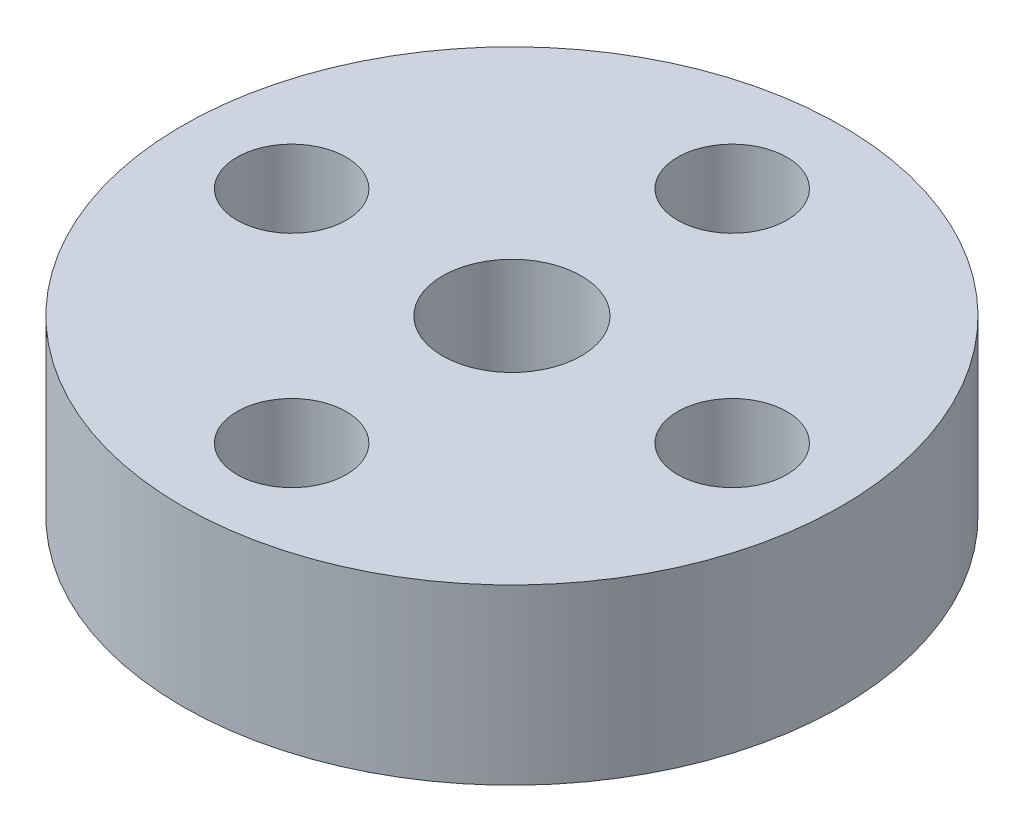
ISO-10303-21;
HEADER;
FILE_DESCRIPTION(('STEP AP214'),'2;1');
FILE_NAME('part.step','',(''),(''),'','','');
FILE_SCHEMA(('AUTOMOTIVE_DESIGN { 1 0 10303 214 1 1 1 1 }'));
ENDSEC;
DATA;
#1=APPLICATION_CONTEXT('core data for automotive mechanical design processes');
#2=APPLICATION_PROTOCOL_DEFINITION('international standard','automotive_design',2000,#1);
#3=PRODUCT_CONTEXT('',#1,'mechanical');
#4=PRODUCT('Part','Part','',(#3));
#5=PRODUCT_RELATED_PRODUCT_CATEGORY('part','',(#4));
#6=PRODUCT_DEFINITION_FORMATION('','',#4);
#7=PRODUCT_DEFINITION_CONTEXT('part definition',#1,'design');
#8=PRODUCT_DEFINITION('design','',#6,#7);
#9=PRODUCT_DEFINITION_SHAPE('','',#8);
#10=(LENGTH_UNIT() NAMED_UNIT(*) SI_UNIT(.MILLI.,.METRE.));
#11=(NAMED_UNIT(*) PLANE_ANGLE_UNIT() SI_UNIT($,.RADIAN.));
#12=(NAMED_UNIT(*) SI_UNIT($,.STERADIAN.) SOLID_ANGLE_UNIT());
#13=UNCERTAINTY_MEASURE_WITH_UNIT(LENGTH_MEASURE(1.E-05),#10,'distance_accuracy_value','');
#14=(GEOMETRIC_REPRESENTATION_CONTEXT(3) GLOBAL_UNCERTAINTY_ASSIGNED_CONTEXT((#13)) GLOBAL_UNIT_ASSIGNED_CONTEXT((#10,
#11,#12)) REPRESENTATION_CONTEXT('',''));
#15=CARTESIAN_POINT('',(0.,0.,0.));
#16=DIRECTION('',(0.,0.,1.));
#17=DIRECTION('',(1.,0.,0.));
#18=AXIS2_PLACEMENT_3D('',#15,#16,#17);
#19=CARTESIAN_POINT('',(0.,5.,0.));
#20=DIRECTION('',(0.,-1.,0.));
#21=DIRECTION('',(0.,0.,-1.));
#22=AXIS2_PLACEMENT_3D('',#19,#20,#21);
#23=CYLINDRICAL_SURFACE('',#22,9.5);
#24=CARTESIAN_POINT('',(0.,5.,0.));
#25=DIRECTION('',(0.,1.,0.));
#26=DIRECTION('',(0.,0.,1.));
#27=AXIS2_PLACEMENT_3D('',#24,#25,#26);
#28=CIRCLE('',#27,9.5);
#29=CARTESIAN_POINT('',(0.,5.,9.5));
#30=VERTEX_POINT('',#29);
#31=EDGE_CURVE('E10',#30,#30,#28,.T.);
#32=ORIENTED_EDGE('',*,*,#31,.F.);
#33=EDGE_LOOP('',(#32));
#34=FACE_BOUND('',#33,.T.);
#35=CARTESIAN_POINT('',(0.,0.,0.));
#36=DIRECTION('',(0.,1.,0.));
#37=DIRECTION('',(0.,0.,1.));
#38=AXIS2_PLACEMENT_3D('',#35,#36,#37);
#39=CIRCLE('',#38,9.5);
#40=CARTESIAN_POINT('',(0.,0.,9.5));
#41=VERTEX_POINT('',#40);
#42=EDGE_CURVE('E34',#41,#41,#39,.T.);
#43=ORIENTED_EDGE('',*,*,#42,.T.);
#44=EDGE_LOOP('',(#43));
#45=FACE_BOUND('',#44,.T.);
#46=ADVANCED_FACE('F31',(#34,#45),#23,.T.);
#47=CARTESIAN_POINT('',(0.,5.,0.));
#48=DIRECTION('',(0.,1.,0.));
#49=DIRECTION('',(0.,0.,1.));
#50=AXIS2_PLACEMENT_3D('',#47,#48,#49);
#51=PLANE('',#50);
#52=CARTESIAN_POINT('',(0.,5.,0.));
#53=DIRECTION('',(0.,1.,0.));
#54=DIRECTION('',(0.,0.,1.));
#55=AXIS2_PLACEMENT_3D('',#52,#53,#54);
#56=CIRCLE('',#55,2.);
#57=CARTESIAN_POINT('',(0.,5.,2.));
#58=VERTEX_POINT('',#57);
#59=EDGE_CURVE('E69',#58,#58,#56,.T.);
#60=ORIENTED_EDGE('',*,*,#59,.F.);
#61=EDGE_LOOP('',(#60));
#62=FACE_BOUND('',#61,.T.);
#63=CARTESIAN_POINT('',(-6.35,5.,0.));
#64=DIRECTION('',(0.,1.,0.));
#65=DIRECTION('',(0.,0.,1.));
#66=AXIS2_PLACEMENT_3D('',#63,#64,#65);
#67=CIRCLE('',#66,1.575);
#68=CARTESIAN_POINT('',(-6.35,5.,1.575));
#69=VERTEX_POINT('',#68);
#70=EDGE_CURVE('E63',#69,#69,#67,.T.);
#71=ORIENTED_EDGE('',*,*,#70,.F.);
#72=EDGE_LOOP('',(#71));
#73=FACE_BOUND('',#72,.T.);
#74=CARTESIAN_POINT('',(0.,5.,6.35));
#75=DIRECTION('',(0.,1.,0.));
#76=DIRECTION('',(0.,0.,1.));
#77=AXIS2_PLACEMENT_3D('',#74,#75,#76);
#78=CIRCLE('',#77,1.575);
#79=CARTESIAN_POINT('',(0.,5.,7.925));
#80=VERTEX_POINT('',#79);
#81=EDGE_CURVE('E57',#80,#80,#78,.T.);
#82=ORIENTED_EDGE('',*,*,#81,.F.);
#83=EDGE_LOOP('',(#82));
#84=FACE_BOUND('',#83,.T.);
#85=CARTESIAN_POINT('',(6.35,5.,0.));
#86=DIRECTION('',(0.,1.,0.));
#87=DIRECTION('',(0.,0.,1.));
#88=AXIS2_PLACEMENT_3D('',#85,#86,#87);
#89=CIRCLE('',#88,1.575);
#90=CARTESIAN_POINT('',(6.35,5.,1.575));
#91=VERTEX_POINT('',#90);
#92=EDGE_CURVE('E51',#91,#91,#89,.T.);
#93=ORIENTED_EDGE('',*,*,#92,.F.);
#94=EDGE_LOOP('',(#93));
#95=FACE_BOUND('',#94,.T.);
#96=CARTESIAN_POINT('',(0.,5.,-6.35));
#97=DIRECTION('',(0.,1.,0.));
#98=DIRECTION('',(0.,0.,1.));
#99=AXIS2_PLACEMENT_3D('',#96,#97,#98);
#100=CIRCLE('',#99,1.575);
#101=CARTESIAN_POINT('',(0.,5.,-4.775));
#102=VERTEX_POINT('',#101);
#103=EDGE_CURVE('E45',#102,#102,#100,.T.);
#104=ORIENTED_EDGE('',*,*,#103,.F.);
#105=EDGE_LOOP('',(#104));
#106=FACE_BOUND('',#105,.T.);
#107=ORIENTED_EDGE('',*,*,#31,.T.);
#108=EDGE_LOOP('',(#107));
#109=FACE_BOUND('',#108,.T.);
#110=ADVANCED_FACE('F75',(#62,#73,#84,#95,#106,#109),#51,.T.);
#111=CARTESIAN_POINT('',(0.,0.,0.));
#112=DIRECTION('',(0.,1.,0.));
#113=DIRECTION('',(0.,0.,1.));
#114=AXIS2_PLACEMENT_3D('',#111,#112,#113);
#115=PLANE('',#114);
#116=CARTESIAN_POINT('',(0.,0.,0.));
#117=DIRECTION('',(0.,1.,0.));
#118=DIRECTION('',(0.,0.,1.));
#119=AXIS2_PLACEMENT_3D('',#116,#117,#118);
#120=CIRCLE('',#119,2.);
#121=CARTESIAN_POINT('',(0.,0.,2.));
#122=VERTEX_POINT('',#121);
#123=EDGE_CURVE('E66',#122,#122,#120,.F.);
#124=ORIENTED_EDGE('',*,*,#123,.F.);
#125=EDGE_LOOP('',(#124));
#126=FACE_BOUND('',#125,.T.);
#127=CARTESIAN_POINT('',(-6.35,0.,0.));
#128=DIRECTION('',(0.,1.,0.));
#129=DIRECTION('',(0.,0.,1.));
#130=AXIS2_PLACEMENT_3D('',#127,#128,#129);
#131=CIRCLE('',#130,1.575);
#132=CARTESIAN_POINT('',(-6.35,0.,1.575));
#133=VERTEX_POINT('',#132);
#134=EDGE_CURVE('E60',#133,#133,#131,.F.);
#135=ORIENTED_EDGE('',*,*,#134,.F.);
#136=EDGE_LOOP('',(#135));
#137=FACE_BOUND('',#136,.T.);
#138=CARTESIAN_POINT('',(0.,0.,6.35));
#139=DIRECTION('',(0.,1.,0.));
#140=DIRECTION('',(0.,0.,1.));
#141=AXIS2_PLACEMENT_3D('',#138,#139,#140);
#142=CIRCLE('',#141,1.575);
#143=CARTESIAN_POINT('',(0.,0.,7.925));
#144=VERTEX_POINT('',#143);
#145=EDGE_CURVE('E54',#144,#144,#142,.F.);
#146=ORIENTED_EDGE('',*,*,#145,.F.);
#147=EDGE_LOOP('',(#146));
#148=FACE_BOUND('',#147,.T.);
#149=CARTESIAN_POINT('',(6.35,0.,0.));
#150=DIRECTION('',(0.,1.,0.));
#151=DIRECTION('',(0.,0.,1.));
#152=AXIS2_PLACEMENT_3D('',#149,#150,#151);
#153=CIRCLE('',#152,1.575);
#154=CARTESIAN_POINT('',(6.35,0.,1.575));
#155=VERTEX_POINT('',#154);
#156=EDGE_CURVE('E48',#155,#155,#153,.F.);
#157=ORIENTED_EDGE('',*,*,#156,.F.);
#158=EDGE_LOOP('',(#157));
#159=FACE_BOUND('',#158,.T.);
#160=CARTESIAN_POINT('',(0.,0.,-6.35));
#161=DIRECTION('',(0.,1.,0.));
#162=DIRECTION('',(0.,0.,1.));
#163=AXIS2_PLACEMENT_3D('',#160,#161,#162);
#164=CIRCLE('',#163,1.575);
#165=CARTESIAN_POINT('',(0.,0.,-4.775));
#166=VERTEX_POINT('',#165);
#167=EDGE_CURVE('E41',#166,#166,#164,.F.);
#168=ORIENTED_EDGE('',*,*,#167,.F.);
#169=EDGE_LOOP('',(#168));
#170=FACE_BOUND('',#169,.T.);
#171=ORIENTED_EDGE('',*,*,#42,.F.);
#172=EDGE_LOOP('',(#171));
#173=FACE_BOUND('',#172,.T.);
#174=ADVANCED_FACE('F78',(#126,#137,#148,#159,#170,#173),#115,.F.);
#175=CARTESIAN_POINT('',(0.,-5.65685424949238,-6.35));
#176=DIRECTION('',(0.,1.,0.));
#177=DIRECTION('',(0.,0.,1.));
#178=AXIS2_PLACEMENT_3D('',#175,#176,#177);
#179=CYLINDRICAL_SURFACE('',#178,1.575);
#180=ORIENTED_EDGE('',*,*,#167,.T.);
#181=EDGE_LOOP('',(#180));
#182=FACE_BOUND('',#181,.T.);
#183=ORIENTED_EDGE('',*,*,#103,.T.);
#184=EDGE_LOOP('',(#183));
#185=FACE_BOUND('',#184,.T.);
#186=ADVANCED_FACE('F88',(#182,#185),#179,.F.);
#187=CARTESIAN_POINT('',(6.35,-5.65685424949238,0.));
#188=DIRECTION('',(0.,1.,0.));
#189=DIRECTION('',(0.,0.,1.));
#190=AXIS2_PLACEMENT_3D('',#187,#188,#189);
#191=CYLINDRICAL_SURFACE('',#190,1.575);
#192=ORIENTED_EDGE('',*,*,#156,.T.);
#193=EDGE_LOOP('',(#192));
#194=FACE_BOUND('',#193,.T.);
#195=ORIENTED_EDGE('',*,*,#92,.T.);
#196=EDGE_LOOP('',(#195));
#197=FACE_BOUND('',#196,.T.);
#198=ADVANCED_FACE('F90',(#194,#197),#191,.F.);
#199=CARTESIAN_POINT('',(0.,-5.65685424949238,6.35));
#200=DIRECTION('',(0.,1.,0.));
#201=DIRECTION('',(0.,0.,1.));
#202=AXIS2_PLACEMENT_3D('',#199,#200,#201);
#203=CYLINDRICAL_SURFACE('',#202,1.575);
#204=ORIENTED_EDGE('',*,*,#145,.T.);
#205=EDGE_LOOP('',(#204));
#206=FACE_BOUND('',#205,.T.);
#207=ORIENTED_EDGE('',*,*,#81,.T.);
#208=EDGE_LOOP('',(#207));
#209=FACE_BOUND('',#208,.T.);
#210=ADVANCED_FACE('F97',(#206,#209),#203,.F.);
#211=CARTESIAN_POINT('',(-6.35,-5.65685424949238,0.));
#212=DIRECTION('',(0.,1.,0.));
#213=DIRECTION('',(0.,0.,1.));
#214=AXIS2_PLACEMENT_3D('',#211,#212,#213);
#215=CYLINDRICAL_SURFACE('',#214,1.575);
#216=ORIENTED_EDGE('',*,*,#134,.T.);
#217=EDGE_LOOP('',(#216));
#218=FACE_BOUND('',#217,.T.);
#219=ORIENTED_EDGE('',*,*,#70,.T.);
#220=EDGE_LOOP('',(#219));
#221=FACE_BOUND('',#220,.T.);
#222=ADVANCED_FACE('F135',(#218,#221),#215,.F.);
#223=CARTESIAN_POINT('',(0.,-5.65685424949238,0.));
#224=DIRECTION('',(0.,1.,0.));
#225=DIRECTION('',(0.,0.,1.));
#226=AXIS2_PLACEMENT_3D('',#223,#224,#225);
#227=CYLINDRICAL_SURFACE('',#226,2.);
#228=ORIENTED_EDGE('',*,*,#123,.T.);
#229=EDGE_LOOP('',(#228));
#230=FACE_BOUND('',#229,.T.);
#231=ORIENTED_EDGE('',*,*,#59,.T.);
#232=EDGE_LOOP('',(#231));
#233=FACE_BOUND('',#232,.T.);
#234=ADVANCED_FACE('F73',(#230,#233),#227,.F.);
#235=CLOSED_SHELL('',(#46,#110,#174,#186,#198,#210,#222,#234));
#236=MANIFOLD_SOLID_BREP('B2',#235);
#237=ADVANCED_BREP_SHAPE_REPRESENTATION('',(#18,#236),#14);
#238=SHAPE_DEFINITION_REPRESENTATION(#9,#237);
ENDSEC;
END-ISO-10303-21;
